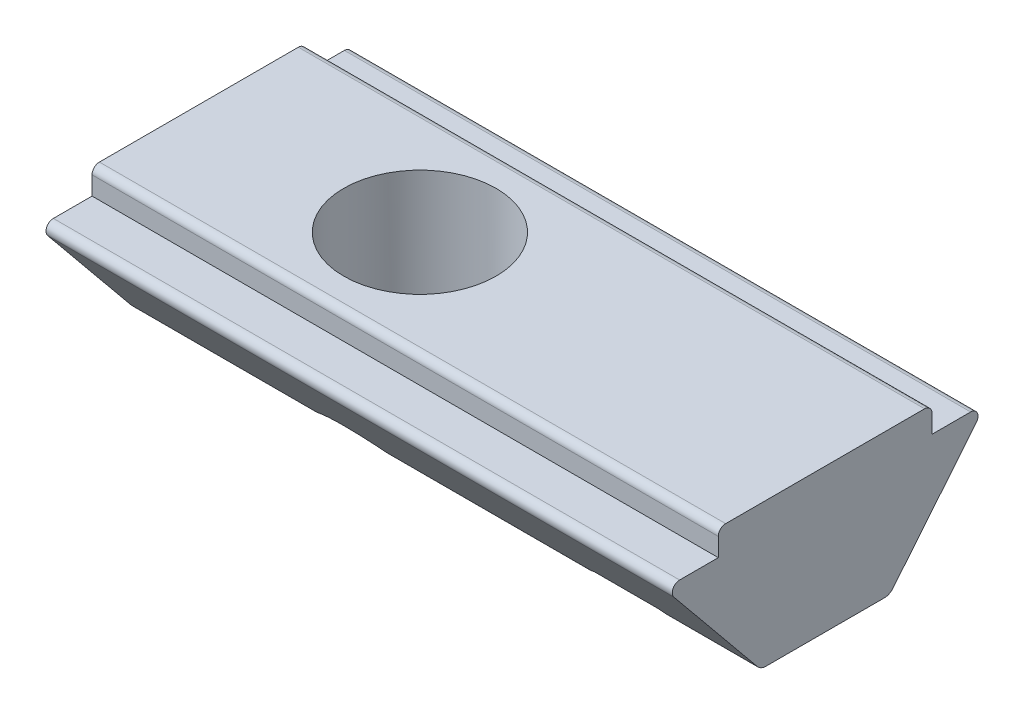
ISO-10303-21;
HEADER;
FILE_DESCRIPTION(('STEP AP214'),'2;1');
FILE_NAME('part.step','',(''),(''),'','','');
FILE_SCHEMA(('AUTOMOTIVE_DESIGN { 1 0 10303 214 1 1 1 1 }'));
ENDSEC;
DATA;
#1=APPLICATION_CONTEXT('core data for automotive mechanical design processes');
#2=APPLICATION_PROTOCOL_DEFINITION('international standard','automotive_design',2000,#1);
#3=PRODUCT_CONTEXT('',#1,'mechanical');
#4=PRODUCT('Part','Part','',(#3));
#5=PRODUCT_RELATED_PRODUCT_CATEGORY('part','',(#4));
#6=PRODUCT_DEFINITION_FORMATION('','',#4);
#7=PRODUCT_DEFINITION_CONTEXT('part definition',#1,'design');
#8=PRODUCT_DEFINITION('design','',#6,#7);
#9=PRODUCT_DEFINITION_SHAPE('','',#8);
#10=(LENGTH_UNIT() NAMED_UNIT(*) SI_UNIT(.MILLI.,.METRE.));
#11=(NAMED_UNIT(*) PLANE_ANGLE_UNIT() SI_UNIT($,.RADIAN.));
#12=(NAMED_UNIT(*) SI_UNIT($,.STERADIAN.) SOLID_ANGLE_UNIT());
#13=UNCERTAINTY_MEASURE_WITH_UNIT(LENGTH_MEASURE(1.E-05),#10,'distance_accuracy_value','');
#14=(GEOMETRIC_REPRESENTATION_CONTEXT(3) GLOBAL_UNCERTAINTY_ASSIGNED_CONTEXT((#13)) GLOBAL_UNIT_ASSIGNED_CONTEXT((#10,
#11,#12)) REPRESENTATION_CONTEXT('',''));
#15=CARTESIAN_POINT('',(0.,0.,0.));
#16=DIRECTION('',(0.,0.,1.));
#17=DIRECTION('',(1.,0.,0.));
#18=AXIS2_PLACEMENT_3D('',#15,#16,#17);
#19=CARTESIAN_POINT('',(11.,-3.9,1.75));
#20=DIRECTION('',(0.,1.,0.));
#21=DIRECTION('',(0.,0.,1.));
#22=AXIS2_PLACEMENT_3D('',#19,#20,#21);
#23=PLANE('',#22);
#24=DIRECTION('',(-1.,0.,0.));
#25=VECTOR('',#24,1.);
#26=CARTESIAN_POINT('',(11.,-3.9,1.60798420710612));
#27=LINE('',#26,#25);
#28=CARTESIAN_POINT('',(6.14930136977293,-3.9,1.60798420710612));
#29=VERTEX_POINT('',#28);
#30=CARTESIAN_POINT('',(1.29879782479695,-3.9,1.60798420710612));
#31=VERTEX_POINT('',#30);
#32=EDGE_CURVE('E363',#29,#31,#27,.T.);
#33=ORIENTED_EDGE('',*,*,#32,.T.);
#34=CARTESIAN_POINT('',(0.,-3.9,0.));
#35=DIRECTION('',(0.,1.,0.));
#36=DIRECTION('',(0.,0.,1.));
#37=AXIS2_PLACEMENT_3D('',#34,#35,#36);
#38=CIRCLE('',#37,2.067);
#39=CARTESIAN_POINT('',(1.29879782479695,-3.9,-1.60798420710612));
#40=VERTEX_POINT('',#39);
#41=EDGE_CURVE('E62',#31,#40,#38,.T.);
#42=ORIENTED_EDGE('',*,*,#41,.T.);
#43=DIRECTION('',(-1.,0.,0.));
#44=VECTOR('',#43,1.);
#45=CARTESIAN_POINT('',(11.,-3.9,-1.60798420710612));
#46=LINE('',#45,#44);
#47=CARTESIAN_POINT('',(6.14930136977293,-3.9,-1.60798420710612));
#48=VERTEX_POINT('',#47);
#49=EDGE_CURVE('E69',#40,#48,#46,.F.);
#50=ORIENTED_EDGE('',*,*,#49,.T.);
#51=CARTESIAN_POINT('',(7.5,-3.9,0.));
#52=DIRECTION('',(0.,1.,0.));
#53=DIRECTION('',(0.,0.,1.));
#54=AXIS2_PLACEMENT_3D('',#51,#52,#53);
#55=CIRCLE('',#54,2.1);
#56=EDGE_CURVE('E357',#48,#29,#55,.T.);
#57=ORIENTED_EDGE('',*,*,#56,.T.);
#58=EDGE_LOOP('',(#33,#42,#50,#57));
#59=FACE_BOUND('',#58,.T.);
#60=ADVANCED_FACE('F41',(#59),#23,.F.);
#61=CARTESIAN_POINT('',(11.,-3.6,-1.60798420710612));
#62=DIRECTION('',(-1.,0.,0.));
#63=DIRECTION('',(0.,0.,1.));
#64=AXIS2_PLACEMENT_3D('',#61,#62,#63);
#65=CYLINDRICAL_SURFACE('',#64,0.3);
#66=CARTESIAN_POINT('',(-1.29879782479695,-3.9,-1.60798420710612));
#67=CARTESIAN_POINT('',(-1.28139332539718,-3.8999913366282,-1.62204413280724));
#68=CARTESIAN_POINT('',(-1.2637780378886,-3.89901337158662,-1.63580294004581));
#69=CARTESIAN_POINT('',(-1.22824320767565,-3.89528995599308,-1.66264913834604));
#70=CARTESIAN_POINT('',(-1.21032389671937,-3.89254579759158,-1.67573701271201));
#71=CARTESIAN_POINT('',(-1.15698296496195,-3.88206265642245,-1.7134011240999));
#72=CARTESIAN_POINT('',(-1.1212595198536,-3.87205743272079,-1.73695573843179));
#73=CARTESIAN_POINT('',(-1.0614481444048,-3.85055595765396,-1.77387346325802));
#74=CARTESIAN_POINT('',(-1.03731451006081,-3.8405750918089,-1.78807732197125));
#75=CARTESIAN_POINT('',(-1.00129022562698,-3.82346449625684,-1.80834175933657));
#76=CARTESIAN_POINT('',(-0.989230523176115,-3.81735565123451,-1.81496419179293));
#77=CARTESIAN_POINT('',(-0.965303428457749,-3.80435844395107,-1.82780303036163));
#78=CARTESIAN_POINT('',(-0.953436189014684,-3.79746949387139,-1.83401912465551));
#79=CARTESIAN_POINT('',(-0.941712120475692,-3.79015832239688,-1.84001828310188));
#80=B_SPLINE_CURVE_WITH_KNOTS('',3,(#66,#67,#68,#69,#70,#71,#72,#73,#74,#75,#76,#77,#78,#79),
.UNSPECIFIED.,.F.,.F.,(4,2,2,2,2,2,4),(0.,0.0670565783991652,0.134064153755101,
0.265343278411629,0.354385398180641,0.399521405994947,0.444691653532908),.UNSPECIFIED.);
#81=CARTESIAN_POINT('',(-1.29879782479695,-3.9,-1.60798420710612));
#82=VERTEX_POINT('',#81);
#83=CARTESIAN_POINT('',(-0.941712120475691,-3.79015832239688,-1.84001828310188));
#84=VERTEX_POINT('',#83);
#85=EDGE_CURVE('E345',#82,#84,#80,.T.);
#86=ORIENTED_EDGE('',*,*,#85,.F.);
#87=CARTESIAN_POINT('',(-6.,-3.9,-1.60798420710612));
#88=VERTEX_POINT('',#87);
#89=EDGE_CURVE('E369',#88,#82,#46,.F.);
#90=ORIENTED_EDGE('',*,*,#89,.F.);
#91=CARTESIAN_POINT('',(-6.,-3.6,-1.60798420710612));
#92=DIRECTION('',(-1.,0.,0.));
#93=DIRECTION('',(0.,0.,1.));
#94=AXIS2_PLACEMENT_3D('',#91,#92,#93);
#95=CIRCLE('',#94,0.3);
#96=CARTESIAN_POINT('',(-6.,-3.79015832239688,-1.84001828310188));
#97=VERTEX_POINT('',#96);
#98=EDGE_CURVE('E368',#97,#88,#95,.T.);
#99=ORIENTED_EDGE('',*,*,#98,.F.);
#100=DIRECTION('',(-1.,0.,0.));
#101=VECTOR('',#100,1.);
#102=CARTESIAN_POINT('',(11.,-3.79015832239688,-1.84001828310188));
#103=LINE('',#102,#101);
#104=EDGE_CURVE('E239',#84,#97,#103,.T.);
#105=ORIENTED_EDGE('',*,*,#104,.F.);
#106=EDGE_LOOP('',(#86,#90,#99,#105));
#107=FACE_BOUND('',#106,.T.);
#108=ADVANCED_FACE('F491',(#107),#65,.T.);
#109=CARTESIAN_POINT('',(11.,-3.6,1.60798420710612));
#110=DIRECTION('',(-1.,0.,0.));
#111=DIRECTION('',(0.,0.,1.));
#112=AXIS2_PLACEMENT_3D('',#109,#110,#111);
#113=CYLINDRICAL_SURFACE('',#112,0.3);
#114=CARTESIAN_POINT('',(-0.94171212047569,-3.79015832239688,1.84001828310188));
#115=CARTESIAN_POINT('',(-0.959192150983021,-3.80102873028117,1.83107687111916));
#116=CARTESIAN_POINT('',(-0.976965891853127,-3.81099455989967,1.82166161124061));
#117=CARTESIAN_POINT('',(-1.01286410259367,-3.82926698530482,1.80194606581505));
#118=CARTESIAN_POINT('',(-1.03098842718604,-3.83757425288216,1.79164614102392));
#119=CARTESIAN_POINT('',(-1.06700022565195,-3.85253621644304,1.77043186600121));
#120=CARTESIAN_POINT('',(-1.08488514164775,-3.85922076261967,1.75953401897907));
#121=CARTESIAN_POINT('',(-1.12065014869521,-3.87115400185978,1.73697425122977));
#122=CARTESIAN_POINT('',(-1.13853023974176,-3.87640269340534,1.7253123296949));
#123=CARTESIAN_POINT('',(-1.18032408007948,-3.88697992569114,1.69710261173498));
#124=CARTESIAN_POINT('',(-1.20419297126868,-3.89171224870109,1.68025639261016));
#125=CARTESIAN_POINT('',(-1.2517757082494,-3.89822699581408,1.64512693366824));
#126=CARTESIAN_POINT('',(-1.27548290295664,-3.89996793944365,1.62682711201027));
#127=CARTESIAN_POINT('',(-1.29879782479695,-3.9,1.60798420710612));
#128=B_SPLINE_CURVE_WITH_KNOTS('',3,(#114,#115,#116,#117,#118,#119,#120,#121,#122,#123,#124,
#125,#126,#127),.UNSPECIFIED.,.F.,.F.,(4,2,2,2,2,2,4),(0.,0.0672722862843358,0.13451726880097,
0.200411151221942,0.26630510330244,0.354914604504489,0.444743195744551),.UNSPECIFIED.);
#129=CARTESIAN_POINT('',(-0.941712120475686,-3.79015832239688,1.84001828310188));
#130=VERTEX_POINT('',#129);
#131=CARTESIAN_POINT('',(-1.29879782479695,-3.9,1.60798420710612));
#132=VERTEX_POINT('',#131);
#133=EDGE_CURVE('E11',#130,#132,#128,.T.);
#134=ORIENTED_EDGE('',*,*,#133,.F.);
#135=DIRECTION('',(-1.,0.,0.));
#136=VECTOR('',#135,1.);
#137=CARTESIAN_POINT('',(11.,-3.79015832239688,1.84001828310188));
#138=LINE('',#137,#136);
#139=CARTESIAN_POINT('',(-6.,-3.79015832239688,1.84001828310188));
#140=VERTEX_POINT('',#139);
#141=EDGE_CURVE('E223',#140,#130,#138,.F.);
#142=ORIENTED_EDGE('',*,*,#141,.F.);
#143=CARTESIAN_POINT('',(-6.,-3.6,1.60798420710612));
#144=DIRECTION('',(-1.,0.,0.));
#145=DIRECTION('',(0.,0.,1.));
#146=AXIS2_PLACEMENT_3D('',#143,#144,#145);
#147=CIRCLE('',#146,0.3);
#148=CARTESIAN_POINT('',(-6.,-3.9,1.60798420710612));
#149=VERTEX_POINT('',#148);
#150=EDGE_CURVE('E232',#149,#140,#147,.T.);
#151=ORIENTED_EDGE('',*,*,#150,.F.);
#152=EDGE_CURVE('E366',#132,#149,#27,.T.);
#153=ORIENTED_EDGE('',*,*,#152,.F.);
#154=EDGE_LOOP('',(#134,#142,#151,#153));
#155=FACE_BOUND('',#154,.T.);
#156=ADVANCED_FACE('F311',(#155),#113,.T.);
#157=CARTESIAN_POINT('',(7.5,-3.7,0.));
#158=DIRECTION('',(0.,-1.,0.));
#159=DIRECTION('',(0.,0.,-1.));
#160=AXIS2_PLACEMENT_3D('',#157,#158,#159);
#161=PLANE('',#160);
#162=DIRECTION('',(-1.,0.,0.));
#163=VECTOR('',#162,1.);
#164=CARTESIAN_POINT('',(11.,-3.7,1.91390551394733));
#165=LINE('',#164,#163);
#166=CARTESIAN_POINT('',(8.36427176494551,-3.7,1.91390551394733));
#167=VERTEX_POINT('',#166);
#168=CARTESIAN_POINT('',(6.63572823505449,-3.7,1.91390551394733));
#169=VERTEX_POINT('',#168);
#170=EDGE_CURVE('E446',#167,#169,#165,.T.);
#171=ORIENTED_EDGE('',*,*,#170,.T.);
#172=CARTESIAN_POINT('',(7.5,-3.7,0.));
#173=DIRECTION('',(0.,1.,0.));
#174=DIRECTION('',(0.,0.,1.));
#175=AXIS2_PLACEMENT_3D('',#172,#173,#174);
#176=CIRCLE('',#175,2.1);
#177=CARTESIAN_POINT('',(6.63572823505449,-3.7,-1.91390551394733));
#178=VERTEX_POINT('',#177);
#179=EDGE_CURVE('E354',#178,#169,#176,.T.);
#180=ORIENTED_EDGE('',*,*,#179,.F.);
#181=DIRECTION('',(1.,0.,0.));
#182=VECTOR('',#181,1.);
#183=CARTESIAN_POINT('',(11.,-3.7,-1.91390551394733));
#184=LINE('',#183,#182);
#185=CARTESIAN_POINT('',(8.36427176494551,-3.7,-1.91390551394733));
#186=VERTEX_POINT('',#185);
#187=EDGE_CURVE('E214',#178,#186,#184,.T.);
#188=ORIENTED_EDGE('',*,*,#187,.T.);
#189=EDGE_CURVE('E355',#167,#186,#176,.T.);
#190=ORIENTED_EDGE('',*,*,#189,.F.);
#191=EDGE_LOOP('',(#171,#180,#188,#190));
#192=FACE_BOUND('',#191,.T.);
#193=CARTESIAN_POINT('',(7.5,-3.7,0.));
#194=DIRECTION('',(0.,1.,0.));
#195=DIRECTION('',(0.,0.,1.));
#196=AXIS2_PLACEMENT_3D('',#193,#194,#195);
#197=CIRCLE('',#196,1.73205080756888);
#198=CARTESIAN_POINT('',(7.5,-3.7,1.73205080756888));
#199=VERTEX_POINT('',#198);
#200=EDGE_CURVE('E351',#199,#199,#197,.T.);
#201=ORIENTED_EDGE('',*,*,#200,.T.);
#202=EDGE_LOOP('',(#201));
#203=FACE_BOUND('',#202,.T.);
#204=ADVANCED_FACE('F286',(#192,#203),#161,.T.);
#205=CARTESIAN_POINT('',(11.,-1.02677221493126,4.10468938399717));
#206=DIRECTION('',(0.,0.633861074656283,-0.77344691998584));
#207=DIRECTION('',(0.,0.77344691998584,0.633861074656283));
#208=AXIS2_PLACEMENT_3D('',#205,#206,#207);
#209=PLANE('',#208);
#210=ORIENTED_EDGE('',*,*,#141,.T.);
#211=CARTESIAN_POINT('',(0.,-6.03537660552699,0.));
#212=DIRECTION('',(0.,0.633861074656283,-0.77344691998584));
#213=DIRECTION('',(0.,0.77344691998584,0.633861074656283));
#214=AXIS2_PLACEMENT_3D('',#211,#212,#213);
#215=ELLIPSE('',#214,3.26096692579025,2.067);
#216=CARTESIAN_POINT('',(0.94171212047569,-3.79015832239688,1.84001828310188));
#217=VERTEX_POINT('',#216);
#218=EDGE_CURVE('E208',#130,#217,#215,.T.);
#219=ORIENTED_EDGE('',*,*,#218,.T.);
#220=CARTESIAN_POINT('',(6.48790676425004,-3.79015832239688,1.84001828310188));
#221=VERTEX_POINT('',#220);
#222=EDGE_CURVE('E219',#217,#221,#138,.F.);
#223=ORIENTED_EDGE('',*,*,#222,.T.);
#224=CARTESIAN_POINT('',(7.5,-6.03537660552698,0.));
#225=DIRECTION('',(0.,0.633861074656283,-0.77344691998584));
#226=DIRECTION('',(0.,0.77344691998584,0.633861074656283));
#227=AXIS2_PLACEMENT_3D('',#224,#225,#226);
#228=ELLIPSE('',#227,3.31302880704379,2.1);
#229=EDGE_CURVE('E301',#169,#221,#228,.F.);
#230=ORIENTED_EDGE('',*,*,#229,.F.);
#231=ORIENTED_EDGE('',*,*,#170,.F.);
#232=CARTESIAN_POINT('',(8.51209323574996,-3.79015832239688,1.84001828310188));
#233=VERTEX_POINT('',#232);
#234=EDGE_CURVE('E467',#233,#167,#228,.F.);
#235=ORIENTED_EDGE('',*,*,#234,.F.);
#236=CARTESIAN_POINT('',(11.,-3.79015832239688,1.84001828310188));
#237=VERTEX_POINT('',#236);
#238=EDGE_CURVE('E229',#233,#237,#138,.F.);
#239=ORIENTED_EDGE('',*,*,#238,.T.);
#240=DIRECTION('',(0.,-0.77344691998584,-0.633861074656283));
#241=VECTOR('',#240,1.);
#242=CARTESIAN_POINT('',(11.,-1.02677221493126,4.10468938399717));
#243=LINE('',#242,#241);
#244=CARTESIAN_POINT('',(11.,-1.02677221493126,4.10468938399717));
#245=VERTEX_POINT('',#244);
#246=EDGE_CURVE('E454',#245,#237,#243,.T.);
#247=ORIENTED_EDGE('',*,*,#246,.F.);
#248=DIRECTION('',(-1.,0.,0.));
#249=VECTOR('',#248,1.);
#250=CARTESIAN_POINT('',(11.,-1.02677221493126,4.10468938399717));
#251=LINE('',#250,#249);
#252=CARTESIAN_POINT('',(-6.,-1.02677221493126,4.10468938399717));
#253=VERTEX_POINT('',#252);
#254=EDGE_CURVE('E389',#245,#253,#251,.T.);
#255=ORIENTED_EDGE('',*,*,#254,.T.);
#256=DIRECTION('',(0.,-0.77344691998584,-0.633861074656283));
#257=VECTOR('',#256,1.);
#258=CARTESIAN_POINT('',(-6.,-1.02677221493126,4.10468938399717));
#259=LINE('',#258,#257);
#260=EDGE_CURVE('E382',#253,#140,#259,.T.);
#261=ORIENTED_EDGE('',*,*,#260,.T.);
#262=EDGE_LOOP('',(#210,#219,#223,#230,#231,#235,#239,#247,#255,#261));
#263=FACE_BOUND('',#262,.T.);
#264=ADVANCED_FACE('F217',(#263),#209,.F.);
#265=ORIENTED_EDGE('',*,*,#89,.T.);
#266=EDGE_CURVE('E344',#82,#132,#38,.T.);
#267=ORIENTED_EDGE('',*,*,#266,.T.);
#268=ORIENTED_EDGE('',*,*,#152,.T.);
#269=DIRECTION('',(0.,0.,-1.));
#270=VECTOR('',#269,1.);
#271=CARTESIAN_POINT('',(-6.,-3.9,1.75));
#272=LINE('',#271,#270);
#273=EDGE_CURVE('E383',#149,#88,#272,.T.);
#274=ORIENTED_EDGE('',*,*,#273,.T.);
#275=EDGE_LOOP('',(#265,#267,#268,#274));
#276=FACE_BOUND('',#275,.T.);
#277=ADVANCED_FACE('F396',(#276),#23,.F.);
#278=CARTESIAN_POINT('',(8.85069863022707,-3.9,1.60798420710612));
#279=VERTEX_POINT('',#278);
#280=CARTESIAN_POINT('',(8.85069863022707,-3.9,-1.60798420710612));
#281=VERTEX_POINT('',#280);
#282=EDGE_CURVE('E358',#279,#281,#55,.T.);
#283=ORIENTED_EDGE('',*,*,#282,.T.);
#284=CARTESIAN_POINT('',(11.,-3.9,-1.60798420710612));
#285=VERTEX_POINT('',#284);
#286=EDGE_CURVE('E403',#281,#285,#46,.F.);
#287=ORIENTED_EDGE('',*,*,#286,.T.);
#288=DIRECTION('',(0.,0.,-1.));
#289=VECTOR('',#288,1.);
#290=CARTESIAN_POINT('',(11.,-3.9,1.75));
#291=LINE('',#290,#289);
#292=CARTESIAN_POINT('',(11.,-3.9,1.60798420710612));
#293=VERTEX_POINT('',#292);
#294=EDGE_CURVE('E452',#293,#285,#291,.T.);
#295=ORIENTED_EDGE('',*,*,#294,.F.);
#296=EDGE_CURVE('E365',#293,#279,#27,.T.);
#297=ORIENTED_EDGE('',*,*,#296,.T.);
#298=EDGE_LOOP('',(#283,#287,#295,#297));
#299=FACE_BOUND('',#298,.T.);
#300=ADVANCED_FACE('F480',(#299),#23,.F.);
#301=CARTESIAN_POINT('',(11.,-3.9,-1.75));
#302=DIRECTION('',(0.,0.633861074656283,0.77344691998584));
#303=DIRECTION('',(0.,-0.77344691998584,0.633861074656283));
#304=AXIS2_PLACEMENT_3D('',#301,#302,#303);
#305=PLANE('',#304);
#306=CARTESIAN_POINT('',(6.48790676425004,-3.79015832239688,-1.84001828310188));
#307=VERTEX_POINT('',#306);
#308=CARTESIAN_POINT('',(0.941712120475692,-3.79015832239688,-1.84001828310188));
#309=VERTEX_POINT('',#308);
#310=EDGE_CURVE('E244',#307,#309,#103,.T.);
#311=ORIENTED_EDGE('',*,*,#310,.T.);
#312=CARTESIAN_POINT('',(0.,-6.03537660552698,0.));
#313=DIRECTION('',(0.,0.633861074656283,0.77344691998584));
#314=DIRECTION('',(0.,0.77344691998584,-0.633861074656283));
#315=AXIS2_PLACEMENT_3D('',#312,#313,#314);
#316=ELLIPSE('',#315,3.26096692579025,2.067);
#317=EDGE_CURVE('E342',#309,#84,#316,.T.);
#318=ORIENTED_EDGE('',*,*,#317,.T.);
#319=ORIENTED_EDGE('',*,*,#104,.T.);
#320=DIRECTION('',(0.,0.77344691998584,-0.633861074656283));
#321=VECTOR('',#320,1.);
#322=CARTESIAN_POINT('',(-6.,-3.9,-1.75));
#323=LINE('',#322,#321);
#324=CARTESIAN_POINT('',(-6.,-1.02677221493126,-4.10468938399717));
#325=VERTEX_POINT('',#324);
#326=EDGE_CURVE('E432',#97,#325,#323,.T.);
#327=ORIENTED_EDGE('',*,*,#326,.T.);
#328=DIRECTION('',(-1.,0.,0.));
#329=VECTOR('',#328,1.);
#330=CARTESIAN_POINT('',(11.,-1.02677221493126,-4.10468938399717));
#331=LINE('',#330,#329);
#332=CARTESIAN_POINT('',(11.,-1.02677221493126,-4.10468938399717));
#333=VERTEX_POINT('',#332);
#334=EDGE_CURVE('E417',#333,#325,#331,.T.);
#335=ORIENTED_EDGE('',*,*,#334,.F.);
#336=DIRECTION('',(0.,0.77344691998584,-0.633861074656283));
#337=VECTOR('',#336,1.);
#338=CARTESIAN_POINT('',(11.,-3.9,-1.75));
#339=LINE('',#338,#337);
#340=CARTESIAN_POINT('',(11.,-3.79015832239688,-1.84001828310188));
#341=VERTEX_POINT('',#340);
#342=EDGE_CURVE('E450',#341,#333,#339,.T.);
#343=ORIENTED_EDGE('',*,*,#342,.F.);
#344=CARTESIAN_POINT('',(8.51209323574996,-3.79015832239688,-1.84001828310188));
#345=VERTEX_POINT('',#344);
#346=EDGE_CURVE('E240',#341,#345,#103,.T.);
#347=ORIENTED_EDGE('',*,*,#346,.T.);
#348=CARTESIAN_POINT('',(7.5,-6.03537660552699,0.));
#349=DIRECTION('',(0.,0.633861074656283,0.77344691998584));
#350=DIRECTION('',(0.,0.77344691998584,-0.633861074656283));
#351=AXIS2_PLACEMENT_3D('',#348,#349,#350);
#352=ELLIPSE('',#351,3.31302880704379,2.1);
#353=EDGE_CURVE('E302',#186,#345,#352,.F.);
#354=ORIENTED_EDGE('',*,*,#353,.F.);
#355=ORIENTED_EDGE('',*,*,#187,.F.);
#356=EDGE_CURVE('E303',#307,#178,#352,.F.);
#357=ORIENTED_EDGE('',*,*,#356,.F.);
#358=EDGE_LOOP('',(#311,#318,#319,#327,#335,#343,#347,#354,#355,#357));
#359=FACE_BOUND('',#358,.T.);
#360=ADVANCED_FACE('F309',(#359),#305,.F.);
#361=ORIENTED_EDGE('',*,*,#238,.F.);
#362=CARTESIAN_POINT('',(8.51209323574996,-3.79015832239688,1.84001828310188));
#363=CARTESIAN_POINT('',(8.52769500721293,-3.8005910710729,1.83144078689479));
#364=CARTESIAN_POINT('',(8.54359698577575,-3.81017896154043,1.82243164309295));
#365=CARTESIAN_POINT('',(8.57577267483371,-3.82780423804079,1.80362299633087));
#366=CARTESIAN_POINT('',(8.59204610500586,-3.83584275271732,1.79382407611948));
#367=CARTESIAN_POINT('',(8.62442768413108,-3.85037442866696,1.77370224339644));
#368=CARTESIAN_POINT('',(8.6405324900023,-3.85689562875157,1.76339399139625));
#369=CARTESIAN_POINT('',(8.67278247629405,-3.86862112592166,1.74211222987166));
#370=CARTESIAN_POINT('',(8.68892766254553,-3.87382522022804,1.73113861823176));
#371=CARTESIAN_POINT('',(8.72950114097922,-3.88525406290604,1.70270807656138));
#372=CARTESIAN_POINT('',(8.753891679936,-3.89061306277078,1.68483510797118));
#373=CARTESIAN_POINT('',(8.80256993362537,-3.89799295843406,1.64750710704617));
#374=CARTESIAN_POINT('',(8.82685001344768,-3.89996009057274,1.62803163178012));
#375=CARTESIAN_POINT('',(8.85069863022707,-3.9,1.60798420710612));
#376=B_SPLINE_CURVE_WITH_KNOTS('',3,(#362,#363,#364,#365,#366,#367,#368,#369,#370,#371,#372,
#373,#374,#375),.UNSPECIFIED.,.F.,.F.,(4,2,2,2,2,2,4),(0.,0.0618527406983386,0.12366025301972,
0.184214049857671,0.244777163779603,0.336685129458319,0.430036954123793),.UNSPECIFIED.);
#377=EDGE_CURVE('E317',#233,#279,#376,.T.);
#378=ORIENTED_EDGE('',*,*,#377,.T.);
#379=ORIENTED_EDGE('',*,*,#296,.F.);
#380=CARTESIAN_POINT('',(11.,-3.6,1.60798420710612));
#381=DIRECTION('',(-1.,0.,0.));
#382=DIRECTION('',(0.,0.,1.));
#383=AXIS2_PLACEMENT_3D('',#380,#381,#382);
#384=CIRCLE('',#383,0.3);
#385=EDGE_CURVE('E237',#237,#293,#384,.F.);
#386=ORIENTED_EDGE('',*,*,#385,.F.);
#387=EDGE_LOOP('',(#361,#378,#379,#386));
#388=FACE_BOUND('',#387,.T.);
#389=ADVANCED_FACE('F305',(#388),#113,.T.);
#390=CARTESIAN_POINT('',(1.29879782479695,-3.9,1.60798420710612));
#391=CARTESIAN_POINT('',(1.28139332539718,-3.8999913366282,1.62204413280724));
#392=CARTESIAN_POINT('',(1.2637780378886,-3.89901337158662,1.63580294004581));
#393=CARTESIAN_POINT('',(1.22824320767565,-3.89528995599308,1.66264913834605));
#394=CARTESIAN_POINT('',(1.21032389671936,-3.89254579759158,1.67573701271201));
#395=CARTESIAN_POINT('',(1.15698296496195,-3.88206265642245,1.7134011240999));
#396=CARTESIAN_POINT('',(1.1212595198536,-3.87205743272078,1.73695573843179));
#397=CARTESIAN_POINT('',(1.0614481444048,-3.85055595765396,1.77387346325802));
#398=CARTESIAN_POINT('',(1.03731451006081,-3.8405750918089,1.78807732197125));
#399=CARTESIAN_POINT('',(1.00129022562697,-3.82346449625684,1.80834175933657));
#400=CARTESIAN_POINT('',(0.989230523176113,-3.81735565123451,1.81496419179293));
#401=CARTESIAN_POINT('',(0.965303428457747,-3.80435844395107,1.82780303036163));
#402=CARTESIAN_POINT('',(0.953436189014682,-3.79746949387139,1.83401912465551));
#403=CARTESIAN_POINT('',(0.94171212047569,-3.79015832239688,1.84001828310188));
#404=B_SPLINE_CURVE_WITH_KNOTS('',3,(#390,#391,#392,#393,#394,#395,#396,#397,#398,#399,#400,
#401,#402,#403),.UNSPECIFIED.,.F.,.F.,(4,2,2,2,2,2,4),(0.,0.0670565783991655,0.134064153755101,
0.265343278411629,0.354385398180641,0.399521405994948,0.444691653532908),.UNSPECIFIED.);
#405=EDGE_CURVE('E55',#31,#217,#404,.T.);
#406=ORIENTED_EDGE('',*,*,#405,.F.);
#407=ORIENTED_EDGE('',*,*,#32,.F.);
#408=CARTESIAN_POINT('',(6.14930136977293,-3.9,1.60798420710612));
#409=CARTESIAN_POINT('',(6.16567979636419,-3.89999225593566,1.62174388844292));
#410=CARTESIAN_POINT('',(6.18225282374827,-3.89905489573211,1.63523601402993));
#411=CARTESIAN_POINT('',(6.21567725436373,-3.89546833329142,1.66161583629764));
#412=CARTESIAN_POINT('',(6.2325284736481,-3.89282022128757,1.67450391232247));
#413=CARTESIAN_POINT('',(6.28263142623132,-3.88267716578713,1.71164021871093));
#414=CARTESIAN_POINT('',(6.31614998953447,-3.87296900963395,1.73496053953022));
#415=CARTESIAN_POINT('',(6.37286082419735,-3.85174395877115,1.77209967735502));
#416=CARTESIAN_POINT('',(6.39611732991248,-3.84165661963092,1.78666229898486));
#417=CARTESIAN_POINT('',(6.43076727342282,-3.82425670464209,1.80746404781954));
#418=CARTESIAN_POINT('',(6.44236280721597,-3.81802395108004,1.81427053869454));
#419=CARTESIAN_POINT('',(6.46532950273643,-3.80473022508209,1.82746648280203));
#420=CARTESIAN_POINT('',(6.476700458603,-3.79766853053108,1.833855564763));
#421=CARTESIAN_POINT('',(6.48790676425004,-3.79015832239688,1.84001828310188));
#422=B_SPLINE_CURVE_WITH_KNOTS('',3,(#408,#409,#410,#411,#412,#413,#414,#415,#416,#417,#418,
#419,#420,#421),.UNSPECIFIED.,.F.,.F.,(4,2,2,2,2,2,4),(0.,0.0641122674314525,0.128183717446111,
0.253552501136603,0.341094338774487,0.385526148445724,0.429996955310443),.UNSPECIFIED.);
#423=EDGE_CURVE('E228',#29,#221,#422,.T.);
#424=ORIENTED_EDGE('',*,*,#423,.T.);
#425=ORIENTED_EDGE('',*,*,#222,.F.);
#426=EDGE_LOOP('',(#406,#407,#424,#425));
#427=FACE_BOUND('',#426,.T.);
#428=ADVANCED_FACE('F227',(#427),#113,.T.);
#429=ORIENTED_EDGE('',*,*,#286,.F.);
#430=CARTESIAN_POINT('',(8.85069863022707,-3.9,-1.60798420710612));
#431=CARTESIAN_POINT('',(8.83432020363581,-3.89999225593566,-1.62174388844292));
#432=CARTESIAN_POINT('',(8.81774717625173,-3.89905489573211,-1.63523601402993));
#433=CARTESIAN_POINT('',(8.78432274563627,-3.89546833329142,-1.66161583629764));
#434=CARTESIAN_POINT('',(8.7674715263519,-3.89282022128757,-1.67450391232247));
#435=CARTESIAN_POINT('',(8.71736857376868,-3.88267716578713,-1.71164021871093));
#436=CARTESIAN_POINT('',(8.68385001046553,-3.87296900963395,-1.73496053953022));
#437=CARTESIAN_POINT('',(8.62713917580265,-3.85174395877115,-1.77209967735502));
#438=CARTESIAN_POINT('',(8.60388267008751,-3.84165661963092,-1.78666229898486));
#439=CARTESIAN_POINT('',(8.56923272657718,-3.82425670464209,-1.80746404781954));
#440=CARTESIAN_POINT('',(8.55763719278403,-3.81802395108004,-1.81427053869454));
#441=CARTESIAN_POINT('',(8.53467049726357,-3.80473022508209,-1.82746648280203));
#442=CARTESIAN_POINT('',(8.523299541397,-3.79766853053108,-1.833855564763));
#443=CARTESIAN_POINT('',(8.51209323574996,-3.79015832239688,-1.84001828310188));
#444=B_SPLINE_CURVE_WITH_KNOTS('',3,(#430,#431,#432,#433,#434,#435,#436,#437,#438,#439,#440,
#441,#442,#443),.UNSPECIFIED.,.F.,.F.,(4,2,2,2,2,2,4),(0.,0.0641122674314522,0.128183717446109,
0.253552501136602,0.341094338774487,0.385526148445726,0.429996955310443),.UNSPECIFIED.);
#445=EDGE_CURVE('E271',#281,#345,#444,.T.);
#446=ORIENTED_EDGE('',*,*,#445,.T.);
#447=ORIENTED_EDGE('',*,*,#346,.F.);
#448=CARTESIAN_POINT('',(11.,-3.6,-1.60798420710612));
#449=DIRECTION('',(-1.,0.,0.));
#450=DIRECTION('',(0.,0.,1.));
#451=AXIS2_PLACEMENT_3D('',#448,#449,#450);
#452=CIRCLE('',#451,0.3);
#453=EDGE_CURVE('E231',#285,#341,#452,.F.);
#454=ORIENTED_EDGE('',*,*,#453,.F.);
#455=EDGE_LOOP('',(#429,#446,#447,#454));
#456=FACE_BOUND('',#455,.T.);
#457=ADVANCED_FACE('F277',(#456),#65,.T.);
#458=CARTESIAN_POINT('',(0.941712120475692,-3.79015832239688,-1.84001828310188));
#459=CARTESIAN_POINT('',(0.959192150983023,-3.80102873028118,-1.83107687111916));
#460=CARTESIAN_POINT('',(0.97696589185313,-3.81099455989967,-1.82166161124061));
#461=CARTESIAN_POINT('',(1.01286410259367,-3.82926698530482,-1.80194606581505));
#462=CARTESIAN_POINT('',(1.03098842718604,-3.83757425288216,-1.79164614102392));
#463=CARTESIAN_POINT('',(1.06700022565195,-3.85253621644304,-1.77043186600121));
#464=CARTESIAN_POINT('',(1.08488514164775,-3.85922076261967,-1.75953401897907));
#465=CARTESIAN_POINT('',(1.12065014869521,-3.87115400185978,-1.73697425122977));
#466=CARTESIAN_POINT('',(1.13853023974176,-3.87640269340534,-1.7253123296949));
#467=CARTESIAN_POINT('',(1.18032408007948,-3.88697992569114,-1.69710261173498));
#468=CARTESIAN_POINT('',(1.20419297126868,-3.89171224870109,-1.68025639261016));
#469=CARTESIAN_POINT('',(1.2517757082494,-3.89822699581408,-1.64512693366824));
#470=CARTESIAN_POINT('',(1.27548290295664,-3.89996793944365,-1.62682711201027));
#471=CARTESIAN_POINT('',(1.29879782479695,-3.9,-1.60798420710612));
#472=B_SPLINE_CURVE_WITH_KNOTS('',3,(#458,#459,#460,#461,#462,#463,#464,#465,#466,#467,#468,
#469,#470,#471),.UNSPECIFIED.,.F.,.F.,(4,2,2,2,2,2,4),(0.,0.0672722862843364,0.13451726880097,
0.200411151221943,0.26630510330244,0.354914604504489,0.444743195744551),.UNSPECIFIED.);
#473=EDGE_CURVE('E335',#309,#40,#472,.T.);
#474=ORIENTED_EDGE('',*,*,#473,.F.);
#475=ORIENTED_EDGE('',*,*,#310,.F.);
#476=CARTESIAN_POINT('',(6.48790676425004,-3.79015832239688,-1.84001828310188));
#477=CARTESIAN_POINT('',(6.47230499278707,-3.8005910710729,-1.83144078689479));
#478=CARTESIAN_POINT('',(6.45640301422425,-3.81017896154043,-1.82243164309295));
#479=CARTESIAN_POINT('',(6.42422732516629,-3.82780423804079,-1.80362299633087));
#480=CARTESIAN_POINT('',(6.40795389499414,-3.83584275271732,-1.79382407611948));
#481=CARTESIAN_POINT('',(6.37557231586892,-3.85037442866696,-1.77370224339644));
#482=CARTESIAN_POINT('',(6.3594675099977,-3.85689562875157,-1.76339399139624));
#483=CARTESIAN_POINT('',(6.32721752370595,-3.86862112592166,-1.74211222987166));
#484=CARTESIAN_POINT('',(6.31107233745447,-3.87382522022804,-1.73113861823176));
#485=CARTESIAN_POINT('',(6.27049885902077,-3.88525406290604,-1.70270807656138));
#486=CARTESIAN_POINT('',(6.24610832006399,-3.89061306277078,-1.68483510797118));
#487=CARTESIAN_POINT('',(6.19743006637463,-3.89799295843406,-1.64750710704617));
#488=CARTESIAN_POINT('',(6.17314998655231,-3.89996009057274,-1.62803163178012));
#489=CARTESIAN_POINT('',(6.14930136977293,-3.9,-1.60798420710612));
#490=B_SPLINE_CURVE_WITH_KNOTS('',3,(#476,#477,#478,#479,#480,#481,#482,#483,#484,#485,#486,
#487,#488,#489),.UNSPECIFIED.,.F.,.F.,(4,2,2,2,2,2,4),(0.,0.0618527406983389,0.12366025301972,
0.184214049857673,0.244777163779606,0.336685129458322,0.430036954123793),.UNSPECIFIED.);
#491=EDGE_CURVE('E262',#307,#48,#490,.T.);
#492=ORIENTED_EDGE('',*,*,#491,.T.);
#493=ORIENTED_EDGE('',*,*,#49,.F.);
#494=EDGE_LOOP('',(#474,#475,#492,#493));
#495=FACE_BOUND('',#494,.T.);
#496=ADVANCED_FACE('F400',(#495),#65,.T.);
#497=CARTESIAN_POINT('',(11.,-0.699999999999999,-2.9));
#498=DIRECTION('',(0.,0.,1.));
#499=DIRECTION('',(0.,-1.,0.));
#500=AXIS2_PLACEMENT_3D('',#497,#498,#499);
#501=PLANE('',#500);
#502=DIRECTION('',(0.,1.,0.));
#503=VECTOR('',#502,1.);
#504=CARTESIAN_POINT('',(-6.,-0.699999999999999,-2.9));
#505=LINE('',#504,#503);
#506=CARTESIAN_POINT('',(-6.,-0.699999999999999,-2.9));
#507=VERTEX_POINT('',#506);
#508=CARTESIAN_POINT('',(-6.,-0.2,-2.9));
#509=VERTEX_POINT('',#508);
#510=EDGE_CURVE('E443',#507,#509,#505,.T.);
#511=ORIENTED_EDGE('',*,*,#510,.T.);
#512=DIRECTION('',(-1.,0.,0.));
#513=VECTOR('',#512,1.);
#514=CARTESIAN_POINT('',(11.,-0.2,-2.9));
#515=LINE('',#514,#513);
#516=CARTESIAN_POINT('',(11.,-0.2,-2.9));
#517=VERTEX_POINT('',#516);
#518=EDGE_CURVE('E260',#509,#517,#515,.F.);
#519=ORIENTED_EDGE('',*,*,#518,.T.);
#520=DIRECTION('',(0.,1.,0.));
#521=VECTOR('',#520,1.);
#522=CARTESIAN_POINT('',(11.,-0.699999999999999,-2.9));
#523=LINE('',#522,#521);
#524=CARTESIAN_POINT('',(11.,-0.699999999999999,-2.9));
#525=VERTEX_POINT('',#524);
#526=EDGE_CURVE('E429',#525,#517,#523,.T.);
#527=ORIENTED_EDGE('',*,*,#526,.F.);
#528=DIRECTION('',(-1.,0.,0.));
#529=VECTOR('',#528,1.);
#530=CARTESIAN_POINT('',(11.,-0.699999999999999,-2.9));
#531=LINE('',#530,#529);
#532=EDGE_CURVE('E423',#525,#507,#531,.T.);
#533=ORIENTED_EDGE('',*,*,#532,.T.);
#534=EDGE_LOOP('',(#511,#519,#527,#533));
#535=FACE_BOUND('',#534,.T.);
#536=ADVANCED_FACE('F312',(#535),#501,.F.);
#537=CARTESIAN_POINT('',(11.,0.,-2.9));
#538=DIRECTION('',(0.,-1.,0.));
#539=DIRECTION('',(0.,0.,-1.));
#540=AXIS2_PLACEMENT_3D('',#537,#538,#539);
#541=PLANE('',#540);
#542=CARTESIAN_POINT('',(0.,0.,0.));
#543=DIRECTION('',(0.,1.,0.));
#544=DIRECTION('',(0.,0.,1.));
#545=AXIS2_PLACEMENT_3D('',#542,#543,#544);
#546=CIRCLE('',#545,2.067);
#547=CARTESIAN_POINT('',(0.,0.,2.067));
#548=VERTEX_POINT('',#547);
#549=EDGE_CURVE('E224',#548,#548,#546,.T.);
#550=ORIENTED_EDGE('',*,*,#549,.F.);
#551=EDGE_LOOP('',(#550));
#552=FACE_BOUND('',#551,.T.);
#553=DIRECTION('',(0.,0.,1.));
#554=VECTOR('',#553,1.);
#555=CARTESIAN_POINT('',(-6.,0.,-2.9));
#556=LINE('',#555,#554);
#557=CARTESIAN_POINT('',(-6.,0.,-2.7));
#558=VERTEX_POINT('',#557);
#559=CARTESIAN_POINT('',(-6.,0.,2.7));
#560=VERTEX_POINT('',#559);
#561=EDGE_CURVE('E440',#558,#560,#556,.T.);
#562=ORIENTED_EDGE('',*,*,#561,.T.);
#563=DIRECTION('',(-1.,0.,0.));
#564=VECTOR('',#563,1.);
#565=CARTESIAN_POINT('',(11.,0.,2.7));
#566=LINE('',#565,#564);
#567=CARTESIAN_POINT('',(11.,0.,2.7));
#568=VERTEX_POINT('',#567);
#569=EDGE_CURVE('E254',#560,#568,#566,.F.);
#570=ORIENTED_EDGE('',*,*,#569,.T.);
#571=DIRECTION('',(0.,0.,1.));
#572=VECTOR('',#571,1.);
#573=CARTESIAN_POINT('',(11.,0.,-2.9));
#574=LINE('',#573,#572);
#575=CARTESIAN_POINT('',(11.,0.,-2.7));
#576=VERTEX_POINT('',#575);
#577=EDGE_CURVE('E463',#576,#568,#574,.T.);
#578=ORIENTED_EDGE('',*,*,#577,.F.);
#579=DIRECTION('',(-1.,0.,0.));
#580=VECTOR('',#579,1.);
#581=CARTESIAN_POINT('',(11.,0.,-2.7));
#582=LINE('',#581,#580);
#583=EDGE_CURVE('E251',#576,#558,#582,.T.);
#584=ORIENTED_EDGE('',*,*,#583,.T.);
#585=EDGE_LOOP('',(#562,#570,#578,#584));
#586=FACE_BOUND('',#585,.T.);
#587=ADVANCED_FACE('F530',(#552,#586),#541,.F.);
#588=CARTESIAN_POINT('',(11.,0.,2.9));
#589=DIRECTION('',(0.,0.,-1.));
#590=DIRECTION('',(0.,1.,0.));
#591=AXIS2_PLACEMENT_3D('',#588,#589,#590);
#592=PLANE('',#591);
#593=DIRECTION('',(0.,-1.,0.));
#594=VECTOR('',#593,1.);
#595=CARTESIAN_POINT('',(11.,0.,2.9));
#596=LINE('',#595,#594);
#597=CARTESIAN_POINT('',(11.,-0.2,2.9));
#598=VERTEX_POINT('',#597);
#599=CARTESIAN_POINT('',(11.,-0.699999999999999,2.9));
#600=VERTEX_POINT('',#599);
#601=EDGE_CURVE('E461',#598,#600,#596,.T.);
#602=ORIENTED_EDGE('',*,*,#601,.F.);
#603=DIRECTION('',(-1.,0.,0.));
#604=VECTOR('',#603,1.);
#605=CARTESIAN_POINT('',(11.,-0.2,2.9));
#606=LINE('',#605,#604);
#607=CARTESIAN_POINT('',(-6.,-0.2,2.9));
#608=VERTEX_POINT('',#607);
#609=EDGE_CURVE('E243',#598,#608,#606,.T.);
#610=ORIENTED_EDGE('',*,*,#609,.T.);
#611=DIRECTION('',(0.,-1.,0.));
#612=VECTOR('',#611,1.);
#613=CARTESIAN_POINT('',(-6.,0.,2.9));
#614=LINE('',#613,#612);
#615=CARTESIAN_POINT('',(-6.,-0.699999999999999,2.9));
#616=VERTEX_POINT('',#615);
#617=EDGE_CURVE('E438',#608,#616,#614,.T.);
#618=ORIENTED_EDGE('',*,*,#617,.T.);
#619=DIRECTION('',(-1.,0.,0.));
#620=VECTOR('',#619,1.);
#621=CARTESIAN_POINT('',(11.,-0.699999999999999,2.9));
#622=LINE('',#621,#620);
#623=EDGE_CURVE('E404',#600,#616,#622,.T.);
#624=ORIENTED_EDGE('',*,*,#623,.F.);
#625=EDGE_LOOP('',(#602,#610,#618,#624));
#626=FACE_BOUND('',#625,.T.);
#627=ADVANCED_FACE('F538',(#626),#592,.F.);
#628=CARTESIAN_POINT('',(11.,-0.699999999999999,2.9));
#629=DIRECTION('',(0.,-1.,0.));
#630=DIRECTION('',(0.,0.,-1.));
#631=AXIS2_PLACEMENT_3D('',#628,#629,#630);
#632=PLANE('',#631);
#633=DIRECTION('',(0.,0.,1.));
#634=VECTOR('',#633,1.);
#635=CARTESIAN_POINT('',(-6.,-0.699999999999999,2.9));
#636=LINE('',#635,#634);
#637=CARTESIAN_POINT('',(-6.,-0.699999999999999,3.95));
#638=VERTEX_POINT('',#637);
#639=EDGE_CURVE('E436',#616,#638,#636,.T.);
#640=ORIENTED_EDGE('',*,*,#639,.T.);
#641=DIRECTION('',(-1.,0.,0.));
#642=VECTOR('',#641,1.);
#643=CARTESIAN_POINT('',(11.,-0.699999999999999,3.95));
#644=LINE('',#643,#642);
#645=CARTESIAN_POINT('',(11.,-0.699999999999999,3.95));
#646=VERTEX_POINT('',#645);
#647=EDGE_CURVE('E408',#646,#638,#644,.T.);
#648=ORIENTED_EDGE('',*,*,#647,.F.);
#649=DIRECTION('',(0.,0.,1.));
#650=VECTOR('',#649,1.);
#651=CARTESIAN_POINT('',(11.,-0.699999999999999,2.9));
#652=LINE('',#651,#650);
#653=EDGE_CURVE('E459',#600,#646,#652,.T.);
#654=ORIENTED_EDGE('',*,*,#653,.F.);
#655=ORIENTED_EDGE('',*,*,#623,.T.);
#656=EDGE_LOOP('',(#640,#648,#654,#655));
#657=FACE_BOUND('',#656,.T.);
#658=ADVANCED_FACE('F540',(#657),#632,.F.);
#659=CARTESIAN_POINT('',(11.,-0.899999999999999,3.95));
#660=DIRECTION('',(-1.,0.,0.));
#661=DIRECTION('',(0.,0.,1.));
#662=AXIS2_PLACEMENT_3D('',#659,#660,#661);
#663=CYLINDRICAL_SURFACE('',#662,0.2);
#664=CARTESIAN_POINT('',(-6.,-0.899999999999999,3.95));
#665=DIRECTION('',(1.,0.,0.));
#666=DIRECTION('',(0.,0.,1.));
#667=AXIS2_PLACEMENT_3D('',#664,#665,#666);
#668=CIRCLE('',#667,0.2);
#669=EDGE_CURVE('E390',#638,#253,#668,.T.);
#670=ORIENTED_EDGE('',*,*,#669,.T.);
#671=ORIENTED_EDGE('',*,*,#254,.F.);
#672=CARTESIAN_POINT('',(11.,-0.899999999999999,3.95));
#673=DIRECTION('',(1.,0.,0.));
#674=DIRECTION('',(0.,0.,1.));
#675=AXIS2_PLACEMENT_3D('',#672,#673,#674);
#676=CIRCLE('',#675,0.2);
#677=EDGE_CURVE('E457',#646,#245,#676,.T.);
#678=ORIENTED_EDGE('',*,*,#677,.F.);
#679=ORIENTED_EDGE('',*,*,#647,.T.);
#680=EDGE_LOOP('',(#670,#671,#678,#679));
#681=FACE_BOUND('',#680,.T.);
#682=ADVANCED_FACE('F543',(#681),#663,.T.);
#683=CARTESIAN_POINT('',(11.,-0.899999999999999,-3.95));
#684=DIRECTION('',(-1.,0.,0.));
#685=DIRECTION('',(0.,0.,1.));
#686=AXIS2_PLACEMENT_3D('',#683,#684,#685);
#687=CYLINDRICAL_SURFACE('',#686,0.2);
#688=CARTESIAN_POINT('',(-6.,-0.899999999999999,-3.95));
#689=DIRECTION('',(1.,0.,0.));
#690=DIRECTION('',(0.,0.,-1.));
#691=AXIS2_PLACEMENT_3D('',#688,#689,#690);
#692=CIRCLE('',#691,0.2);
#693=CARTESIAN_POINT('',(-6.,-0.699999999999999,-3.95));
#694=VERTEX_POINT('',#693);
#695=EDGE_CURVE('E430',#325,#694,#692,.T.);
#696=ORIENTED_EDGE('',*,*,#695,.T.);
#697=DIRECTION('',(-1.,0.,0.));
#698=VECTOR('',#697,1.);
#699=CARTESIAN_POINT('',(11.,-0.699999999999999,-3.95));
#700=LINE('',#699,#698);
#701=CARTESIAN_POINT('',(11.,-0.699999999999999,-3.95));
#702=VERTEX_POINT('',#701);
#703=EDGE_CURVE('E420',#702,#694,#700,.T.);
#704=ORIENTED_EDGE('',*,*,#703,.F.);
#705=CARTESIAN_POINT('',(11.,-0.899999999999999,-3.95));
#706=DIRECTION('',(1.,0.,0.));
#707=DIRECTION('',(0.,0.,-1.));
#708=AXIS2_PLACEMENT_3D('',#705,#706,#707);
#709=CIRCLE('',#708,0.2);
#710=EDGE_CURVE('E448',#333,#702,#709,.T.);
#711=ORIENTED_EDGE('',*,*,#710,.F.);
#712=ORIENTED_EDGE('',*,*,#334,.T.);
#713=EDGE_LOOP('',(#696,#704,#711,#712));
#714=FACE_BOUND('',#713,.T.);
#715=ADVANCED_FACE('F514',(#714),#687,.T.);
#716=CARTESIAN_POINT('',(11.,-0.699999999999999,-3.95));
#717=DIRECTION('',(0.,-1.,0.));
#718=DIRECTION('',(0.,0.,-1.));
#719=AXIS2_PLACEMENT_3D('',#716,#717,#718);
#720=PLANE('',#719);
#721=DIRECTION('',(0.,0.,1.));
#722=VECTOR('',#721,1.);
#723=CARTESIAN_POINT('',(-6.,-0.699999999999999,-3.95));
#724=LINE('',#723,#722);
#725=EDGE_CURVE('E427',#694,#507,#724,.T.);
#726=ORIENTED_EDGE('',*,*,#725,.T.);
#727=ORIENTED_EDGE('',*,*,#532,.F.);
#728=DIRECTION('',(0.,0.,1.));
#729=VECTOR('',#728,1.);
#730=CARTESIAN_POINT('',(11.,-0.699999999999999,-3.95));
#731=LINE('',#730,#729);
#732=EDGE_CURVE('E426',#702,#525,#731,.T.);
#733=ORIENTED_EDGE('',*,*,#732,.F.);
#734=ORIENTED_EDGE('',*,*,#703,.T.);
#735=EDGE_LOOP('',(#726,#727,#733,#734));
#736=FACE_BOUND('',#735,.T.);
#737=ADVANCED_FACE('F520',(#736),#720,.F.);
#738=CARTESIAN_POINT('',(11.,-0.899999999999999,3.95));
#739=DIRECTION('',(-1.,0.,0.));
#740=DIRECTION('',(0.,0.,1.));
#741=AXIS2_PLACEMENT_3D('',#738,#739,#740);
#742=PLANE('',#741);
#743=ORIENTED_EDGE('',*,*,#577,.T.);
#744=CARTESIAN_POINT('',(11.,-0.2,2.7));
#745=DIRECTION('',(-1.,0.,0.));
#746=DIRECTION('',(0.,0.,1.));
#747=AXIS2_PLACEMENT_3D('',#744,#745,#746);
#748=CIRCLE('',#747,0.2);
#749=EDGE_CURVE('E258',#568,#598,#748,.F.);
#750=ORIENTED_EDGE('',*,*,#749,.T.);
#751=ORIENTED_EDGE('',*,*,#601,.T.);
#752=ORIENTED_EDGE('',*,*,#653,.T.);
#753=ORIENTED_EDGE('',*,*,#677,.T.);
#754=ORIENTED_EDGE('',*,*,#246,.T.);
#755=ORIENTED_EDGE('',*,*,#385,.T.);
#756=ORIENTED_EDGE('',*,*,#294,.T.);
#757=ORIENTED_EDGE('',*,*,#453,.T.);
#758=ORIENTED_EDGE('',*,*,#342,.T.);
#759=ORIENTED_EDGE('',*,*,#710,.T.);
#760=ORIENTED_EDGE('',*,*,#732,.T.);
#761=ORIENTED_EDGE('',*,*,#526,.T.);
#762=CARTESIAN_POINT('',(11.,-0.2,-2.7));
#763=DIRECTION('',(-1.,0.,0.));
#764=DIRECTION('',(0.,0.,1.));
#765=AXIS2_PLACEMENT_3D('',#762,#763,#764);
#766=CIRCLE('',#765,0.2);
#767=EDGE_CURVE('E256',#517,#576,#766,.F.);
#768=ORIENTED_EDGE('',*,*,#767,.T.);
#769=EDGE_LOOP('',(#743,#750,#751,#752,#753,#754,#755,#756,#757,#758,#759,#760,#761,#768));
#770=FACE_BOUND('',#769,.T.);
#771=ADVANCED_FACE('F288',(#770),#742,.F.);
#772=CARTESIAN_POINT('',(-6.,-0.899999999999999,3.95));
#773=DIRECTION('',(-1.,0.,0.));
#774=DIRECTION('',(0.,0.,1.));
#775=AXIS2_PLACEMENT_3D('',#772,#773,#774);
#776=PLANE('',#775);
#777=ORIENTED_EDGE('',*,*,#617,.F.);
#778=CARTESIAN_POINT('',(-6.,-0.2,2.7));
#779=DIRECTION('',(-1.,0.,0.));
#780=DIRECTION('',(0.,0.,1.));
#781=AXIS2_PLACEMENT_3D('',#778,#779,#780);
#782=CIRCLE('',#781,0.2);
#783=EDGE_CURVE('E249',#608,#560,#782,.T.);
#784=ORIENTED_EDGE('',*,*,#783,.T.);
#785=ORIENTED_EDGE('',*,*,#561,.F.);
#786=CARTESIAN_POINT('',(-6.,-0.2,-2.7));
#787=DIRECTION('',(-1.,0.,0.));
#788=DIRECTION('',(0.,0.,1.));
#789=AXIS2_PLACEMENT_3D('',#786,#787,#788);
#790=CIRCLE('',#789,0.2);
#791=EDGE_CURVE('E247',#558,#509,#790,.T.);
#792=ORIENTED_EDGE('',*,*,#791,.T.);
#793=ORIENTED_EDGE('',*,*,#510,.F.);
#794=ORIENTED_EDGE('',*,*,#725,.F.);
#795=ORIENTED_EDGE('',*,*,#695,.F.);
#796=ORIENTED_EDGE('',*,*,#326,.F.);
#797=ORIENTED_EDGE('',*,*,#98,.T.);
#798=ORIENTED_EDGE('',*,*,#273,.F.);
#799=ORIENTED_EDGE('',*,*,#150,.T.);
#800=ORIENTED_EDGE('',*,*,#260,.F.);
#801=ORIENTED_EDGE('',*,*,#669,.F.);
#802=ORIENTED_EDGE('',*,*,#639,.F.);
#803=EDGE_LOOP('',(#777,#784,#785,#792,#793,#794,#795,#796,#797,#798,#799,#800,#801,#802));
#804=FACE_BOUND('',#803,.T.);
#805=ADVANCED_FACE('F380',(#804),#776,.T.);
#806=CARTESIAN_POINT('',(11.,-0.2,2.7));
#807=DIRECTION('',(-1.,0.,0.));
#808=DIRECTION('',(0.,0.,1.));
#809=AXIS2_PLACEMENT_3D('',#806,#807,#808);
#810=CYLINDRICAL_SURFACE('',#809,0.2);
#811=ORIENTED_EDGE('',*,*,#749,.F.);
#812=ORIENTED_EDGE('',*,*,#569,.F.);
#813=ORIENTED_EDGE('',*,*,#783,.F.);
#814=ORIENTED_EDGE('',*,*,#609,.F.);
#815=EDGE_LOOP('',(#811,#812,#813,#814));
#816=FACE_BOUND('',#815,.T.);
#817=ADVANCED_FACE('F534',(#816),#810,.T.);
#818=CARTESIAN_POINT('',(11.,-0.2,-2.7));
#819=DIRECTION('',(-1.,0.,0.));
#820=DIRECTION('',(0.,0.,1.));
#821=AXIS2_PLACEMENT_3D('',#818,#819,#820);
#822=CYLINDRICAL_SURFACE('',#821,0.2);
#823=ORIENTED_EDGE('',*,*,#767,.F.);
#824=ORIENTED_EDGE('',*,*,#518,.F.);
#825=ORIENTED_EDGE('',*,*,#791,.F.);
#826=ORIENTED_EDGE('',*,*,#583,.F.);
#827=EDGE_LOOP('',(#823,#824,#825,#826));
#828=FACE_BOUND('',#827,.T.);
#829=ADVANCED_FACE('F43',(#828),#822,.T.);
#830=CARTESIAN_POINT('',(7.5,1.66554857329047,0.));
#831=DIRECTION('',(0.,1.,0.));
#832=DIRECTION('',(0.,0.,1.));
#833=AXIS2_PLACEMENT_3D('',#830,#831,#832);
#834=CYLINDRICAL_SURFACE('',#833,2.1);
#835=ORIENTED_EDGE('',*,*,#234,.T.);
#836=ORIENTED_EDGE('',*,*,#189,.T.);
#837=ORIENTED_EDGE('',*,*,#353,.T.);
#838=ORIENTED_EDGE('',*,*,#445,.F.);
#839=ORIENTED_EDGE('',*,*,#282,.F.);
#840=ORIENTED_EDGE('',*,*,#377,.F.);
#841=EDGE_LOOP('',(#835,#836,#837,#838,#839,#840));
#842=FACE_BOUND('',#841,.T.);
#843=ADVANCED_FACE('F279',(#842),#834,.F.);
#844=ORIENTED_EDGE('',*,*,#229,.T.);
#845=ORIENTED_EDGE('',*,*,#423,.F.);
#846=ORIENTED_EDGE('',*,*,#56,.F.);
#847=ORIENTED_EDGE('',*,*,#491,.F.);
#848=ORIENTED_EDGE('',*,*,#356,.T.);
#849=ORIENTED_EDGE('',*,*,#179,.T.);
#850=EDGE_LOOP('',(#844,#845,#846,#847,#848,#849));
#851=FACE_BOUND('',#850,.T.);
#852=ADVANCED_FACE('F284',(#851),#834,.F.);
#853=CARTESIAN_POINT('',(7.5,-2.7,0.));
#854=DIRECTION('',(0.,1.,0.));
#855=DIRECTION('',(0.,0.,1.));
#856=AXIS2_PLACEMENT_3D('',#853,#854,#855);
#857=SPHERICAL_SURFACE('',#856,2.);
#858=ORIENTED_EDGE('',*,*,#200,.F.);
#859=EDGE_LOOP('',(#858));
#860=FACE_BOUND('',#859,.T.);
#861=ADVANCED_FACE('F329',(#860),#857,.T.);
#862=CARTESIAN_POINT('',(0.,0.,0.));
#863=DIRECTION('',(0.,1.,0.));
#864=DIRECTION('',(0.,0.,1.));
#865=AXIS2_PLACEMENT_3D('',#862,#863,#864);
#866=CYLINDRICAL_SURFACE('',#865,2.067);
#867=ORIENTED_EDGE('',*,*,#85,.T.);
#868=ORIENTED_EDGE('',*,*,#317,.F.);
#869=ORIENTED_EDGE('',*,*,#473,.T.);
#870=ORIENTED_EDGE('',*,*,#41,.F.);
#871=ORIENTED_EDGE('',*,*,#405,.T.);
#872=ORIENTED_EDGE('',*,*,#218,.F.);
#873=ORIENTED_EDGE('',*,*,#133,.T.);
#874=ORIENTED_EDGE('',*,*,#266,.F.);
#875=EDGE_LOOP('',(#867,#868,#869,#870,#871,#872,#873,#874));
#876=FACE_BOUND('',#875,.T.);
#877=ORIENTED_EDGE('',*,*,#549,.T.);
#878=EDGE_LOOP('',(#877));
#879=FACE_BOUND('',#878,.T.);
#880=ADVANCED_FACE('F206',(#876,#879),#866,.F.);
#881=CLOSED_SHELL('',(#60,#108,#156,#204,#264,#277,#300,#360,#389,#428,#457,#496,#536,#587,#627,
#658,#682,#715,#737,#771,#805,#817,#829,#843,#852,#861,#880));
#882=MANIFOLD_SOLID_BREP('B2',#881);
#883=ADVANCED_BREP_SHAPE_REPRESENTATION('',(#18,#882),#14);
#884=SHAPE_DEFINITION_REPRESENTATION(#9,#883);
ENDSEC;
END-ISO-10303-21;
